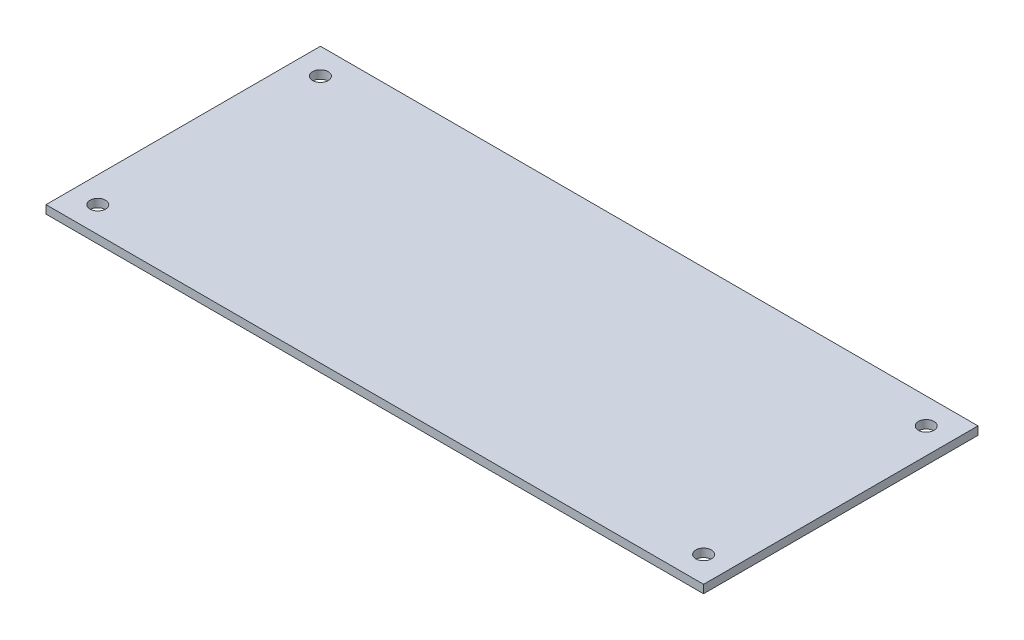
ISO-10303-21;
HEADER;
FILE_DESCRIPTION(('STEP AP214'),'2;1');
FILE_NAME('part.step','',(''),(''),'','','');
FILE_SCHEMA(('AUTOMOTIVE_DESIGN { 1 0 10303 214 1 1 1 1 }'));
ENDSEC;
DATA;
#1=APPLICATION_CONTEXT('core data for automotive mechanical design processes');
#2=APPLICATION_PROTOCOL_DEFINITION('international standard','automotive_design',2000,#1);
#3=PRODUCT_CONTEXT('',#1,'mechanical');
#4=PRODUCT('Part','Part','',(#3));
#5=PRODUCT_RELATED_PRODUCT_CATEGORY('part','',(#4));
#6=PRODUCT_DEFINITION_FORMATION('','',#4);
#7=PRODUCT_DEFINITION_CONTEXT('part definition',#1,'design');
#8=PRODUCT_DEFINITION('design','',#6,#7);
#9=PRODUCT_DEFINITION_SHAPE('','',#8);
#10=(LENGTH_UNIT() NAMED_UNIT(*) SI_UNIT(.MILLI.,.METRE.));
#11=(NAMED_UNIT(*) PLANE_ANGLE_UNIT() SI_UNIT($,.RADIAN.));
#12=(NAMED_UNIT(*) SI_UNIT($,.STERADIAN.) SOLID_ANGLE_UNIT());
#13=UNCERTAINTY_MEASURE_WITH_UNIT(LENGTH_MEASURE(1.E-05),#10,'distance_accuracy_value','');
#14=(GEOMETRIC_REPRESENTATION_CONTEXT(3) GLOBAL_UNCERTAINTY_ASSIGNED_CONTEXT((#13)) GLOBAL_UNIT_ASSIGNED_CONTEXT((#10,
#11,#12)) REPRESENTATION_CONTEXT('',''));
#15=CARTESIAN_POINT('',(0.,0.,0.));
#16=DIRECTION('',(0.,0.,1.));
#17=DIRECTION('',(1.,0.,0.));
#18=AXIS2_PLACEMENT_3D('',#15,#16,#17);
#19=CARTESIAN_POINT('',(-63.5,1.5875,26.5));
#20=DIRECTION('',(-1.,0.,0.));
#21=DIRECTION('',(0.,0.,1.));
#22=AXIS2_PLACEMENT_3D('',#19,#20,#21);
#23=PLANE('',#22);
#24=DIRECTION('',(0.,0.,-1.));
#25=VECTOR('',#24,1.);
#26=CARTESIAN_POINT('',(-63.5,0.,26.5));
#27=LINE('',#26,#25);
#28=CARTESIAN_POINT('',(-63.5,0.,26.5));
#29=VERTEX_POINT('',#28);
#30=CARTESIAN_POINT('',(-63.5,0.,-26.5));
#31=VERTEX_POINT('',#30);
#32=EDGE_CURVE('E101',#29,#31,#27,.T.);
#33=ORIENTED_EDGE('',*,*,#32,.F.);
#34=DIRECTION('',(0.,-1.,0.));
#35=VECTOR('',#34,1.);
#36=CARTESIAN_POINT('',(-63.5,1.5875,26.5));
#37=LINE('',#36,#35);
#38=CARTESIAN_POINT('',(-63.5,1.5875,26.5));
#39=VERTEX_POINT('',#38);
#40=EDGE_CURVE('E11',#39,#29,#37,.T.);
#41=ORIENTED_EDGE('',*,*,#40,.F.);
#42=DIRECTION('',(0.,0.,-1.));
#43=VECTOR('',#42,1.);
#44=CARTESIAN_POINT('',(-63.5,1.5875,26.5));
#45=LINE('',#44,#43);
#46=CARTESIAN_POINT('',(-63.5,1.5875,-26.5));
#47=VERTEX_POINT('',#46);
#48=EDGE_CURVE('E95',#39,#47,#45,.T.);
#49=ORIENTED_EDGE('',*,*,#48,.T.);
#50=DIRECTION('',(0.,-1.,0.));
#51=VECTOR('',#50,1.);
#52=CARTESIAN_POINT('',(-63.5,1.5875,-26.5));
#53=LINE('',#52,#51);
#54=EDGE_CURVE('E38',#47,#31,#53,.T.);
#55=ORIENTED_EDGE('',*,*,#54,.T.);
#56=EDGE_LOOP('',(#33,#41,#49,#55));
#57=FACE_BOUND('',#56,.T.);
#58=ADVANCED_FACE('F35',(#57),#23,.T.);
#59=CARTESIAN_POINT('',(-63.5,1.5875,26.5));
#60=DIRECTION('',(0.,0.,-1.));
#61=DIRECTION('',(-1.,0.,0.));
#62=AXIS2_PLACEMENT_3D('',#59,#60,#61);
#63=PLANE('',#62);
#64=DIRECTION('',(1.,0.,0.));
#65=VECTOR('',#64,1.);
#66=CARTESIAN_POINT('',(-63.5,0.,26.5));
#67=LINE('',#66,#65);
#68=CARTESIAN_POINT('',(63.5,0.,26.5));
#69=VERTEX_POINT('',#68);
#70=EDGE_CURVE('E68',#29,#69,#67,.T.);
#71=ORIENTED_EDGE('',*,*,#70,.T.);
#72=DIRECTION('',(0.,-1.,0.));
#73=VECTOR('',#72,1.);
#74=CARTESIAN_POINT('',(63.5,1.5875,26.5));
#75=LINE('',#74,#73);
#76=CARTESIAN_POINT('',(63.5,1.5875,26.5));
#77=VERTEX_POINT('',#76);
#78=EDGE_CURVE('E44',#77,#69,#75,.T.);
#79=ORIENTED_EDGE('',*,*,#78,.F.);
#80=DIRECTION('',(1.,0.,0.));
#81=VECTOR('',#80,1.);
#82=CARTESIAN_POINT('',(-63.5,1.5875,26.5));
#83=LINE('',#82,#81);
#84=EDGE_CURVE('E85',#39,#77,#83,.T.);
#85=ORIENTED_EDGE('',*,*,#84,.F.);
#86=ORIENTED_EDGE('',*,*,#40,.T.);
#87=EDGE_LOOP('',(#71,#79,#85,#86));
#88=FACE_BOUND('',#87,.T.);
#89=ADVANCED_FACE('F112',(#88),#63,.F.);
#90=CARTESIAN_POINT('',(63.5,1.5875,26.5));
#91=DIRECTION('',(-1.,0.,0.));
#92=DIRECTION('',(0.,0.,1.));
#93=AXIS2_PLACEMENT_3D('',#90,#91,#92);
#94=PLANE('',#93);
#95=DIRECTION('',(0.,0.,-1.));
#96=VECTOR('',#95,1.);
#97=CARTESIAN_POINT('',(63.5,0.,26.5));
#98=LINE('',#97,#96);
#99=CARTESIAN_POINT('',(63.5,0.,-26.5));
#100=VERTEX_POINT('',#99);
#101=EDGE_CURVE('E92',#69,#100,#98,.T.);
#102=ORIENTED_EDGE('',*,*,#101,.T.);
#103=DIRECTION('',(0.,-1.,0.));
#104=VECTOR('',#103,1.);
#105=CARTESIAN_POINT('',(63.5,1.5875,-26.5));
#106=LINE('',#105,#104);
#107=CARTESIAN_POINT('',(63.5,1.5875,-26.5));
#108=VERTEX_POINT('',#107);
#109=EDGE_CURVE('E89',#108,#100,#106,.T.);
#110=ORIENTED_EDGE('',*,*,#109,.F.);
#111=DIRECTION('',(0.,0.,-1.));
#112=VECTOR('',#111,1.);
#113=CARTESIAN_POINT('',(63.5,1.5875,26.5));
#114=LINE('',#113,#112);
#115=EDGE_CURVE('E80',#77,#108,#114,.T.);
#116=ORIENTED_EDGE('',*,*,#115,.F.);
#117=ORIENTED_EDGE('',*,*,#78,.T.);
#118=EDGE_LOOP('',(#102,#110,#116,#117));
#119=FACE_BOUND('',#118,.T.);
#120=ADVANCED_FACE('F90',(#119),#94,.F.);
#121=CARTESIAN_POINT('',(-63.5,1.5875,-26.5));
#122=DIRECTION('',(0.,0.,-1.));
#123=DIRECTION('',(-1.,0.,0.));
#124=AXIS2_PLACEMENT_3D('',#121,#122,#123);
#125=PLANE('',#124);
#126=DIRECTION('',(1.,0.,0.));
#127=VECTOR('',#126,1.);
#128=CARTESIAN_POINT('',(-63.5,0.,-26.5));
#129=LINE('',#128,#127);
#130=EDGE_CURVE('E104',#31,#100,#129,.T.);
#131=ORIENTED_EDGE('',*,*,#130,.F.);
#132=ORIENTED_EDGE('',*,*,#54,.F.);
#133=DIRECTION('',(1.,0.,0.));
#134=VECTOR('',#133,1.);
#135=CARTESIAN_POINT('',(-63.5,1.5875,-26.5));
#136=LINE('',#135,#134);
#137=EDGE_CURVE('E84',#47,#108,#136,.T.);
#138=ORIENTED_EDGE('',*,*,#137,.T.);
#139=ORIENTED_EDGE('',*,*,#109,.T.);
#140=EDGE_LOOP('',(#131,#132,#138,#139));
#141=FACE_BOUND('',#140,.T.);
#142=ADVANCED_FACE('F94',(#141),#125,.T.);
#143=CARTESIAN_POINT('',(0.,1.5875,0.));
#144=DIRECTION('',(0.,-1.,0.));
#145=DIRECTION('',(0.,0.,-1.));
#146=AXIS2_PLACEMENT_3D('',#143,#144,#145);
#147=PLANE('',#146);
#148=CARTESIAN_POINT('',(-58.5,1.5875,-21.5));
#149=DIRECTION('',(0.,1.,0.));
#150=DIRECTION('',(0.,0.,1.));
#151=AXIS2_PLACEMENT_3D('',#148,#149,#150);
#152=CIRCLE('',#151,1.5);
#153=CARTESIAN_POINT('',(-58.5,1.5875,-20.));
#154=VERTEX_POINT('',#153);
#155=EDGE_CURVE('E157',#154,#154,#152,.T.);
#156=ORIENTED_EDGE('',*,*,#155,.F.);
#157=EDGE_LOOP('',(#156));
#158=FACE_BOUND('',#157,.T.);
#159=CARTESIAN_POINT('',(58.5,1.5875,-21.5));
#160=DIRECTION('',(0.,1.,0.));
#161=DIRECTION('',(0.,0.,1.));
#162=AXIS2_PLACEMENT_3D('',#159,#160,#161);
#163=CIRCLE('',#162,1.5);
#164=CARTESIAN_POINT('',(58.5,1.5875,-20.));
#165=VERTEX_POINT('',#164);
#166=EDGE_CURVE('E159',#165,#165,#163,.T.);
#167=ORIENTED_EDGE('',*,*,#166,.F.);
#168=EDGE_LOOP('',(#167));
#169=FACE_BOUND('',#168,.T.);
#170=CARTESIAN_POINT('',(58.5,1.5875,21.5));
#171=DIRECTION('',(0.,1.,0.));
#172=DIRECTION('',(0.,0.,1.));
#173=AXIS2_PLACEMENT_3D('',#170,#171,#172);
#174=CIRCLE('',#173,1.5);
#175=CARTESIAN_POINT('',(58.5,1.5875,23.));
#176=VERTEX_POINT('',#175);
#177=EDGE_CURVE('E165',#176,#176,#174,.T.);
#178=ORIENTED_EDGE('',*,*,#177,.F.);
#179=EDGE_LOOP('',(#178));
#180=FACE_BOUND('',#179,.T.);
#181=CARTESIAN_POINT('',(-58.5,1.5875,21.5));
#182=DIRECTION('',(0.,1.,0.));
#183=DIRECTION('',(0.,0.,1.));
#184=AXIS2_PLACEMENT_3D('',#181,#182,#183);
#185=CIRCLE('',#184,1.5);
#186=CARTESIAN_POINT('',(-58.5,1.5875,23.));
#187=VERTEX_POINT('',#186);
#188=EDGE_CURVE('E171',#187,#187,#185,.T.);
#189=ORIENTED_EDGE('',*,*,#188,.F.);
#190=EDGE_LOOP('',(#189));
#191=FACE_BOUND('',#190,.T.);
#192=ORIENTED_EDGE('',*,*,#48,.F.);
#193=ORIENTED_EDGE('',*,*,#84,.T.);
#194=ORIENTED_EDGE('',*,*,#115,.T.);
#195=ORIENTED_EDGE('',*,*,#137,.F.);
#196=EDGE_LOOP('',(#192,#193,#194,#195));
#197=FACE_BOUND('',#196,.T.);
#198=ADVANCED_FACE('F83',(#158,#169,#180,#191,#197),#147,.F.);
#199=CARTESIAN_POINT('',(0.,0.,0.));
#200=DIRECTION('',(0.,-1.,0.));
#201=DIRECTION('',(0.,0.,-1.));
#202=AXIS2_PLACEMENT_3D('',#199,#200,#201);
#203=PLANE('',#202);
#204=CARTESIAN_POINT('',(-58.5,0.,-21.5));
#205=DIRECTION('',(0.,1.,0.));
#206=DIRECTION('',(0.,0.,1.));
#207=AXIS2_PLACEMENT_3D('',#204,#205,#206);
#208=CIRCLE('',#207,1.5);
#209=CARTESIAN_POINT('',(-58.5,0.,-20.));
#210=VERTEX_POINT('',#209);
#211=EDGE_CURVE('E155',#210,#210,#208,.T.);
#212=ORIENTED_EDGE('',*,*,#211,.T.);
#213=EDGE_LOOP('',(#212));
#214=FACE_BOUND('',#213,.T.);
#215=CARTESIAN_POINT('',(58.5,0.,-21.5));
#216=DIRECTION('',(0.,1.,0.));
#217=DIRECTION('',(0.,0.,1.));
#218=AXIS2_PLACEMENT_3D('',#215,#216,#217);
#219=CIRCLE('',#218,1.5);
#220=CARTESIAN_POINT('',(58.5,0.,-20.));
#221=VERTEX_POINT('',#220);
#222=EDGE_CURVE('E162',#221,#221,#219,.T.);
#223=ORIENTED_EDGE('',*,*,#222,.T.);
#224=EDGE_LOOP('',(#223));
#225=FACE_BOUND('',#224,.T.);
#226=CARTESIAN_POINT('',(58.5,0.,21.5));
#227=DIRECTION('',(0.,1.,0.));
#228=DIRECTION('',(0.,0.,1.));
#229=AXIS2_PLACEMENT_3D('',#226,#227,#228);
#230=CIRCLE('',#229,1.5);
#231=CARTESIAN_POINT('',(58.5,0.,23.));
#232=VERTEX_POINT('',#231);
#233=EDGE_CURVE('E168',#232,#232,#230,.T.);
#234=ORIENTED_EDGE('',*,*,#233,.T.);
#235=EDGE_LOOP('',(#234));
#236=FACE_BOUND('',#235,.T.);
#237=CARTESIAN_POINT('',(-58.5,0.,21.5));
#238=DIRECTION('',(0.,1.,0.));
#239=DIRECTION('',(0.,0.,1.));
#240=AXIS2_PLACEMENT_3D('',#237,#238,#239);
#241=CIRCLE('',#240,1.5);
#242=CARTESIAN_POINT('',(-58.5,0.,23.));
#243=VERTEX_POINT('',#242);
#244=EDGE_CURVE('E105',#243,#243,#241,.T.);
#245=ORIENTED_EDGE('',*,*,#244,.T.);
#246=EDGE_LOOP('',(#245));
#247=FACE_BOUND('',#246,.T.);
#248=ORIENTED_EDGE('',*,*,#32,.T.);
#249=ORIENTED_EDGE('',*,*,#130,.T.);
#250=ORIENTED_EDGE('',*,*,#101,.F.);
#251=ORIENTED_EDGE('',*,*,#70,.F.);
#252=EDGE_LOOP('',(#248,#249,#250,#251));
#253=FACE_BOUND('',#252,.T.);
#254=ADVANCED_FACE('F110',(#214,#225,#236,#247,#253),#203,.T.);
#255=CARTESIAN_POINT('',(-58.5,0.,21.5));
#256=DIRECTION('',(0.,1.,0.));
#257=DIRECTION('',(0.,0.,1.));
#258=AXIS2_PLACEMENT_3D('',#255,#256,#257);
#259=CYLINDRICAL_SURFACE('',#258,1.5);
#260=ORIENTED_EDGE('',*,*,#244,.F.);
#261=EDGE_LOOP('',(#260));
#262=FACE_BOUND('',#261,.T.);
#263=ORIENTED_EDGE('',*,*,#188,.T.);
#264=EDGE_LOOP('',(#263));
#265=FACE_BOUND('',#264,.T.);
#266=ADVANCED_FACE('F131',(#262,#265),#259,.F.);
#267=CARTESIAN_POINT('',(58.5,0.,21.5));
#268=DIRECTION('',(0.,1.,0.));
#269=DIRECTION('',(0.,0.,1.));
#270=AXIS2_PLACEMENT_3D('',#267,#268,#269);
#271=CYLINDRICAL_SURFACE('',#270,1.5);
#272=ORIENTED_EDGE('',*,*,#233,.F.);
#273=EDGE_LOOP('',(#272));
#274=FACE_BOUND('',#273,.T.);
#275=ORIENTED_EDGE('',*,*,#177,.T.);
#276=EDGE_LOOP('',(#275));
#277=FACE_BOUND('',#276,.T.);
#278=ADVANCED_FACE('F138',(#274,#277),#271,.F.);
#279=CARTESIAN_POINT('',(58.5,0.,-21.5));
#280=DIRECTION('',(0.,1.,0.));
#281=DIRECTION('',(0.,0.,1.));
#282=AXIS2_PLACEMENT_3D('',#279,#280,#281);
#283=CYLINDRICAL_SURFACE('',#282,1.5);
#284=ORIENTED_EDGE('',*,*,#222,.F.);
#285=EDGE_LOOP('',(#284));
#286=FACE_BOUND('',#285,.T.);
#287=ORIENTED_EDGE('',*,*,#166,.T.);
#288=EDGE_LOOP('',(#287));
#289=FACE_BOUND('',#288,.T.);
#290=ADVANCED_FACE('F142',(#286,#289),#283,.F.);
#291=CARTESIAN_POINT('',(-58.5,0.,-21.5));
#292=DIRECTION('',(0.,1.,0.));
#293=DIRECTION('',(0.,0.,1.));
#294=AXIS2_PLACEMENT_3D('',#291,#292,#293);
#295=CYLINDRICAL_SURFACE('',#294,1.5);
#296=ORIENTED_EDGE('',*,*,#211,.F.);
#297=EDGE_LOOP('',(#296));
#298=FACE_BOUND('',#297,.T.);
#299=ORIENTED_EDGE('',*,*,#155,.T.);
#300=EDGE_LOOP('',(#299));
#301=FACE_BOUND('',#300,.T.);
#302=ADVANCED_FACE('F146',(#298,#301),#295,.F.);
#303=CLOSED_SHELL('',(#58,#89,#120,#142,#198,#254,#266,#278,#290,#302));
#304=MANIFOLD_SOLID_BREP('B2',#303);
#305=ADVANCED_BREP_SHAPE_REPRESENTATION('',(#18,#304),#14);
#306=SHAPE_DEFINITION_REPRESENTATION(#9,#305);
ENDSEC;
END-ISO-10303-21;
